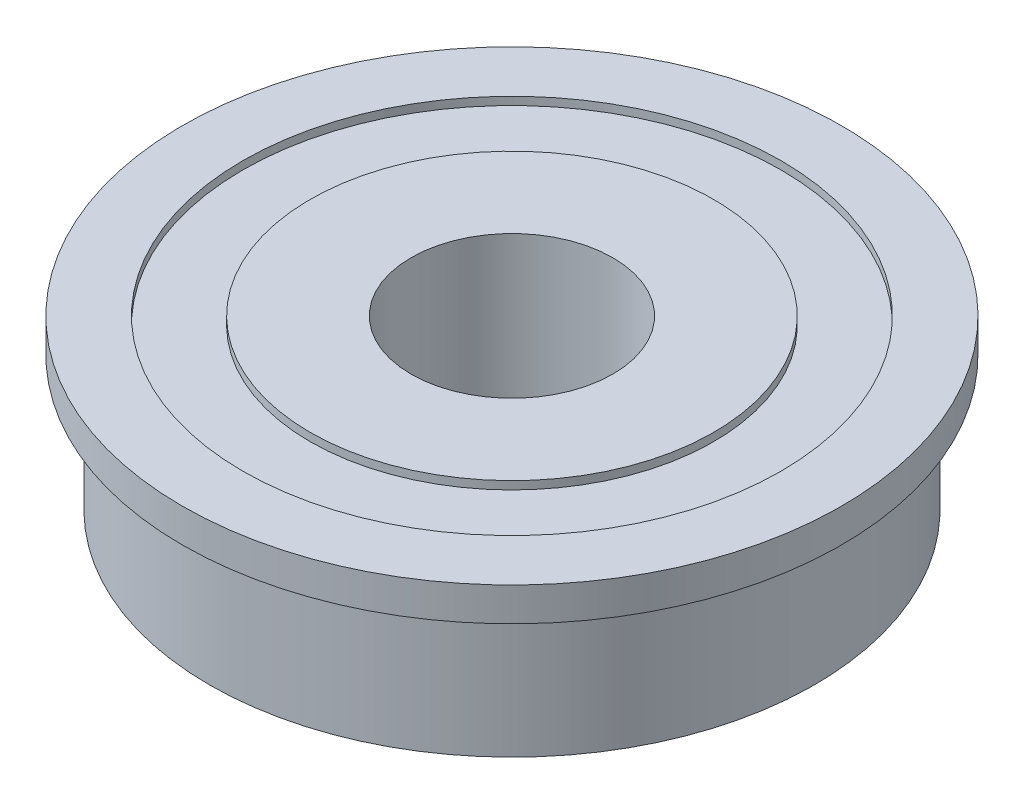
ISO-10303-21;
HEADER;
FILE_DESCRIPTION(('STEP AP214'),'2;1');
FILE_NAME('part.step','',(''),(''),'','','');
FILE_SCHEMA(('AUTOMOTIVE_DESIGN { 1 0 10303 214 1 1 1 1 }'));
ENDSEC;
DATA;
#1=APPLICATION_CONTEXT('core data for automotive mechanical design processes');
#2=APPLICATION_PROTOCOL_DEFINITION('international standard','automotive_design',2000,#1);
#3=PRODUCT_CONTEXT('',#1,'mechanical');
#4=PRODUCT('Part','Part','',(#3));
#5=PRODUCT_RELATED_PRODUCT_CATEGORY('part','',(#4));
#6=PRODUCT_DEFINITION_FORMATION('','',#4);
#7=PRODUCT_DEFINITION_CONTEXT('part definition',#1,'design');
#8=PRODUCT_DEFINITION('design','',#6,#7);
#9=PRODUCT_DEFINITION_SHAPE('','',#8);
#10=(LENGTH_UNIT() NAMED_UNIT(*) SI_UNIT(.MILLI.,.METRE.));
#11=(NAMED_UNIT(*) PLANE_ANGLE_UNIT() SI_UNIT($,.RADIAN.));
#12=(NAMED_UNIT(*) SI_UNIT($,.STERADIAN.) SOLID_ANGLE_UNIT());
#13=UNCERTAINTY_MEASURE_WITH_UNIT(LENGTH_MEASURE(1.E-05),#10,'distance_accuracy_value','');
#14=(GEOMETRIC_REPRESENTATION_CONTEXT(3) GLOBAL_UNCERTAINTY_ASSIGNED_CONTEXT((#13)) GLOBAL_UNIT_ASSIGNED_CONTEXT((#10,
#11,#12)) REPRESENTATION_CONTEXT('',''));
#15=CARTESIAN_POINT('',(0.,0.,0.));
#16=DIRECTION('',(0.,0.,1.));
#17=DIRECTION('',(1.,0.,0.));
#18=AXIS2_PLACEMENT_3D('',#15,#16,#17);
#19=CARTESIAN_POINT('',(0.,0.,0.));
#20=DIRECTION('',(0.,1.,0.));
#21=DIRECTION('',(0.,0.,1.));
#22=AXIS2_PLACEMENT_3D('',#19,#20,#21);
#23=CYLINDRICAL_SURFACE('',#22,12.7);
#24=CARTESIAN_POINT('',(0.,7.9375,0.));
#25=DIRECTION('',(0.,1.,0.));
#26=DIRECTION('',(0.,0.,1.));
#27=AXIS2_PLACEMENT_3D('',#24,#25,#26);
#28=CIRCLE('',#27,12.7);
#29=CARTESIAN_POINT('',(0.,7.9375,12.7));
#30=VERTEX_POINT('',#29);
#31=EDGE_CURVE('E45',#30,#30,#28,.F.);
#32=ORIENTED_EDGE('',*,*,#31,.F.);
#33=EDGE_LOOP('',(#32));
#34=FACE_BOUND('',#33,.T.);
#35=CARTESIAN_POINT('',(0.,7.5565,0.));
#36=DIRECTION('',(0.,1.,0.));
#37=DIRECTION('',(0.,0.,1.));
#38=AXIS2_PLACEMENT_3D('',#35,#36,#37);
#39=CIRCLE('',#38,12.7);
#40=CARTESIAN_POINT('',(0.,7.5565,12.7));
#41=VERTEX_POINT('',#40);
#42=EDGE_CURVE('E17',#41,#41,#39,.T.);
#43=ORIENTED_EDGE('',*,*,#42,.F.);
#44=EDGE_LOOP('',(#43));
#45=FACE_BOUND('',#44,.T.);
#46=ADVANCED_FACE('F14',(#34,#45),#23,.F.);
#47=CARTESIAN_POINT('',(9.525,7.5565,0.));
#48=DIRECTION('',(0.,1.,0.));
#49=DIRECTION('',(0.,0.,1.));
#50=AXIS2_PLACEMENT_3D('',#47,#48,#49);
#51=PLANE('',#50);
#52=CARTESIAN_POINT('',(0.,7.5565,0.));
#53=DIRECTION('',(0.,1.,0.));
#54=DIRECTION('',(0.,0.,1.));
#55=AXIS2_PLACEMENT_3D('',#52,#53,#54);
#56=CIRCLE('',#55,9.525);
#57=CARTESIAN_POINT('',(0.,7.5565,9.525));
#58=VERTEX_POINT('',#57);
#59=EDGE_CURVE('E43',#58,#58,#56,.T.);
#60=ORIENTED_EDGE('',*,*,#59,.F.);
#61=EDGE_LOOP('',(#60));
#62=FACE_BOUND('',#61,.T.);
#63=ORIENTED_EDGE('',*,*,#42,.T.);
#64=EDGE_LOOP('',(#63));
#65=FACE_BOUND('',#64,.T.);
#66=ADVANCED_FACE('F52',(#62,#65),#51,.T.);
#67=CARTESIAN_POINT('',(12.7,7.9375,0.));
#68=DIRECTION('',(0.,1.,0.));
#69=DIRECTION('',(0.,0.,1.));
#70=AXIS2_PLACEMENT_3D('',#67,#68,#69);
#71=PLANE('',#70);
#72=ORIENTED_EDGE('',*,*,#31,.T.);
#73=EDGE_LOOP('',(#72));
#74=FACE_BOUND('',#73,.T.);
#75=CARTESIAN_POINT('',(0.,7.9375,0.));
#76=DIRECTION('',(0.,1.,0.));
#77=DIRECTION('',(0.,0.,1.));
#78=AXIS2_PLACEMENT_3D('',#75,#76,#77);
#79=CIRCLE('',#78,15.5575);
#80=CARTESIAN_POINT('',(0.,7.9375,15.5575));
#81=VERTEX_POINT('',#80);
#82=EDGE_CURVE('E40',#81,#81,#79,.F.);
#83=ORIENTED_EDGE('',*,*,#82,.F.);
#84=EDGE_LOOP('',(#83));
#85=FACE_BOUND('',#84,.T.);
#86=ADVANCED_FACE('F60',(#74,#85),#71,.T.);
#87=CARTESIAN_POINT('',(0.,0.,0.));
#88=DIRECTION('',(0.,1.,0.));
#89=DIRECTION('',(0.,0.,1.));
#90=AXIS2_PLACEMENT_3D('',#87,#88,#89);
#91=CYLINDRICAL_SURFACE('',#90,9.525);
#92=ORIENTED_EDGE('',*,*,#59,.T.);
#93=EDGE_LOOP('',(#92));
#94=FACE_BOUND('',#93,.T.);
#95=CARTESIAN_POINT('',(0.,7.9375,0.));
#96=DIRECTION('',(0.,1.,0.));
#97=DIRECTION('',(0.,0.,1.));
#98=AXIS2_PLACEMENT_3D('',#95,#96,#97);
#99=CIRCLE('',#98,9.525);
#100=CARTESIAN_POINT('',(0.,7.9375,9.525));
#101=VERTEX_POINT('',#100);
#102=EDGE_CURVE('E37',#101,#101,#99,.T.);
#103=ORIENTED_EDGE('',*,*,#102,.F.);
#104=EDGE_LOOP('',(#103));
#105=FACE_BOUND('',#104,.T.);
#106=ADVANCED_FACE('F88',(#94,#105),#91,.T.);
#107=CARTESIAN_POINT('',(0.,0.,0.));
#108=DIRECTION('',(0.,1.,0.));
#109=DIRECTION('',(0.,0.,1.));
#110=AXIS2_PLACEMENT_3D('',#107,#108,#109);
#111=CYLINDRICAL_SURFACE('',#110,15.5575);
#112=CARTESIAN_POINT('',(0.,6.35,0.));
#113=DIRECTION('',(0.,1.,0.));
#114=DIRECTION('',(0.,0.,1.));
#115=AXIS2_PLACEMENT_3D('',#112,#113,#114);
#116=CIRCLE('',#115,15.5575);
#117=CARTESIAN_POINT('',(0.,6.35,15.5575));
#118=VERTEX_POINT('',#117);
#119=EDGE_CURVE('E34',#118,#118,#116,.F.);
#120=ORIENTED_EDGE('',*,*,#119,.F.);
#121=EDGE_LOOP('',(#120));
#122=FACE_BOUND('',#121,.T.);
#123=ORIENTED_EDGE('',*,*,#82,.T.);
#124=EDGE_LOOP('',(#123));
#125=FACE_BOUND('',#124,.T.);
#126=ADVANCED_FACE('F84',(#122,#125),#111,.T.);
#127=CARTESIAN_POINT('',(4.7625,7.9375,0.));
#128=DIRECTION('',(0.,1.,0.));
#129=DIRECTION('',(0.,0.,1.));
#130=AXIS2_PLACEMENT_3D('',#127,#128,#129);
#131=PLANE('',#130);
#132=CARTESIAN_POINT('',(0.,7.9375,0.));
#133=DIRECTION('',(0.,1.,0.));
#134=DIRECTION('',(0.,0.,1.));
#135=AXIS2_PLACEMENT_3D('',#132,#133,#134);
#136=CIRCLE('',#135,4.7625);
#137=CARTESIAN_POINT('',(0.,7.9375,4.7625));
#138=VERTEX_POINT('',#137);
#139=EDGE_CURVE('E31',#138,#138,#136,.F.);
#140=ORIENTED_EDGE('',*,*,#139,.T.);
#141=EDGE_LOOP('',(#140));
#142=FACE_BOUND('',#141,.T.);
#143=ORIENTED_EDGE('',*,*,#102,.T.);
#144=EDGE_LOOP('',(#143));
#145=FACE_BOUND('',#144,.T.);
#146=ADVANCED_FACE('F80',(#142,#145),#131,.T.);
#147=CARTESIAN_POINT('',(15.5575,6.35,0.));
#148=DIRECTION('',(0.,-1.,0.));
#149=DIRECTION('',(0.,0.,-1.));
#150=AXIS2_PLACEMENT_3D('',#147,#148,#149);
#151=PLANE('',#150);
#152=ORIENTED_EDGE('',*,*,#119,.T.);
#153=EDGE_LOOP('',(#152));
#154=FACE_BOUND('',#153,.T.);
#155=CARTESIAN_POINT('',(0.,6.35,0.));
#156=DIRECTION('',(0.,1.,0.));
#157=DIRECTION('',(0.,0.,1.));
#158=AXIS2_PLACEMENT_3D('',#155,#156,#157);
#159=CIRCLE('',#158,14.2875);
#160=CARTESIAN_POINT('',(0.,6.35,14.2875));
#161=VERTEX_POINT('',#160);
#162=EDGE_CURVE('E26',#161,#161,#159,.F.);
#163=ORIENTED_EDGE('',*,*,#162,.F.);
#164=EDGE_LOOP('',(#163));
#165=FACE_BOUND('',#164,.T.);
#166=ADVANCED_FACE('F76',(#154,#165),#151,.T.);
#167=CARTESIAN_POINT('',(0.,0.,0.));
#168=DIRECTION('',(0.,1.,0.));
#169=DIRECTION('',(0.,0.,1.));
#170=AXIS2_PLACEMENT_3D('',#167,#168,#169);
#171=CYLINDRICAL_SURFACE('',#170,4.7625);
#172=ORIENTED_EDGE('',*,*,#139,.F.);
#173=EDGE_LOOP('',(#172));
#174=FACE_BOUND('',#173,.T.);
#175=CARTESIAN_POINT('',(0.,0.,0.));
#176=DIRECTION('',(0.,1.,0.));
#177=DIRECTION('',(0.,0.,1.));
#178=AXIS2_PLACEMENT_3D('',#175,#176,#177);
#179=CIRCLE('',#178,4.7625);
#180=CARTESIAN_POINT('',(0.,0.,4.7625));
#181=VERTEX_POINT('',#180);
#182=EDGE_CURVE('E21',#181,#181,#179,.T.);
#183=ORIENTED_EDGE('',*,*,#182,.F.);
#184=EDGE_LOOP('',(#183));
#185=FACE_BOUND('',#184,.T.);
#186=ADVANCED_FACE('F69',(#174,#185),#171,.F.);
#187=CARTESIAN_POINT('',(0.,0.,0.));
#188=DIRECTION('',(0.,1.,0.));
#189=DIRECTION('',(0.,0.,1.));
#190=AXIS2_PLACEMENT_3D('',#187,#188,#189);
#191=CYLINDRICAL_SURFACE('',#190,14.2875);
#192=CARTESIAN_POINT('',(0.,0.,0.));
#193=DIRECTION('',(0.,1.,0.));
#194=DIRECTION('',(0.,0.,1.));
#195=AXIS2_PLACEMENT_3D('',#192,#193,#194);
#196=CIRCLE('',#195,14.2875);
#197=CARTESIAN_POINT('',(0.,0.,14.2875));
#198=VERTEX_POINT('',#197);
#199=EDGE_CURVE('E9',#198,#198,#196,.F.);
#200=ORIENTED_EDGE('',*,*,#199,.F.);
#201=EDGE_LOOP('',(#200));
#202=FACE_BOUND('',#201,.T.);
#203=ORIENTED_EDGE('',*,*,#162,.T.);
#204=EDGE_LOOP('',(#203));
#205=FACE_BOUND('',#204,.T.);
#206=ADVANCED_FACE('F64',(#202,#205),#191,.T.);
#207=CARTESIAN_POINT('',(14.2875,0.,0.));
#208=DIRECTION('',(0.,-1.,0.));
#209=DIRECTION('',(0.,0.,-1.));
#210=AXIS2_PLACEMENT_3D('',#207,#208,#209);
#211=PLANE('',#210);
#212=ORIENTED_EDGE('',*,*,#199,.T.);
#213=EDGE_LOOP('',(#212));
#214=FACE_BOUND('',#213,.T.);
#215=ORIENTED_EDGE('',*,*,#182,.T.);
#216=EDGE_LOOP('',(#215));
#217=FACE_BOUND('',#216,.T.);
#218=ADVANCED_FACE('F62',(#214,#217),#211,.T.);
#219=CLOSED_SHELL('',(#46,#66,#86,#106,#126,#146,#166,#186,#206,#218));
#220=MANIFOLD_SOLID_BREP('B1',#219);
#221=ADVANCED_BREP_SHAPE_REPRESENTATION('',(#18,#220),#14);
#222=SHAPE_DEFINITION_REPRESENTATION(#9,#221);
ENDSEC;
END-ISO-10303-21;
